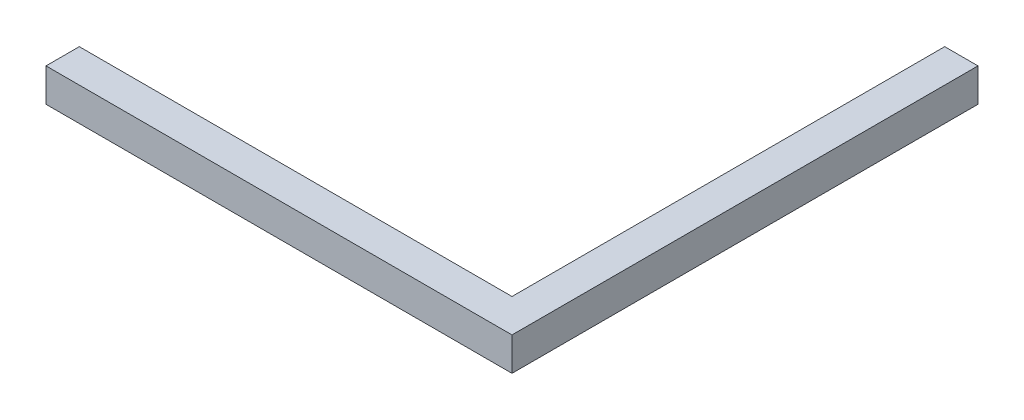
ISO-10303-21;
HEADER;
FILE_DESCRIPTION(('STEP AP214'),'2;1');
FILE_NAME('part.step','',(''),(''),'','','');
FILE_SCHEMA(('AUTOMOTIVE_DESIGN { 1 0 10303 214 1 1 1 1 }'));
ENDSEC;
DATA;
#1=APPLICATION_CONTEXT('core data for automotive mechanical design processes');
#2=APPLICATION_PROTOCOL_DEFINITION('international standard','automotive_design',2000,#1);
#3=PRODUCT_CONTEXT('',#1,'mechanical');
#4=PRODUCT('Part','Part','',(#3));
#5=PRODUCT_RELATED_PRODUCT_CATEGORY('part','',(#4));
#6=PRODUCT_DEFINITION_FORMATION('','',#4);
#7=PRODUCT_DEFINITION_CONTEXT('part definition',#1,'design');
#8=PRODUCT_DEFINITION('design','',#6,#7);
#9=PRODUCT_DEFINITION_SHAPE('','',#8);
#10=(LENGTH_UNIT() NAMED_UNIT(*) SI_UNIT(.MILLI.,.METRE.));
#11=(NAMED_UNIT(*) PLANE_ANGLE_UNIT() SI_UNIT($,.RADIAN.));
#12=(NAMED_UNIT(*) SI_UNIT($,.STERADIAN.) SOLID_ANGLE_UNIT());
#13=UNCERTAINTY_MEASURE_WITH_UNIT(LENGTH_MEASURE(1.E-05),#10,'distance_accuracy_value','');
#14=(GEOMETRIC_REPRESENTATION_CONTEXT(3) GLOBAL_UNCERTAINTY_ASSIGNED_CONTEXT((#13)) GLOBAL_UNIT_ASSIGNED_CONTEXT((#10,
#11,#12)) REPRESENTATION_CONTEXT('',''));
#15=CARTESIAN_POINT('',(0.,0.,0.));
#16=DIRECTION('',(0.,0.,1.));
#17=DIRECTION('',(1.,0.,0.));
#18=AXIS2_PLACEMENT_3D('',#15,#16,#17);
#19=CARTESIAN_POINT('',(70.,10.,70.));
#20=DIRECTION('',(-1.,0.,0.));
#21=DIRECTION('',(0.,0.,1.));
#22=AXIS2_PLACEMENT_3D('',#19,#20,#21);
#23=PLANE('',#22);
#24=DIRECTION('',(0.,0.,-1.));
#25=VECTOR('',#24,1.);
#26=CARTESIAN_POINT('',(70.,0.,70.));
#27=LINE('',#26,#25);
#28=CARTESIAN_POINT('',(70.,0.,70.));
#29=VERTEX_POINT('',#28);
#30=CARTESIAN_POINT('',(70.,0.,-70.));
#31=VERTEX_POINT('',#30);
#32=EDGE_CURVE('E118',#29,#31,#27,.T.);
#33=ORIENTED_EDGE('',*,*,#32,.T.);
#34=DIRECTION('',(0.,-1.,0.));
#35=VECTOR('',#34,1.);
#36=CARTESIAN_POINT('',(70.,10.,-70.));
#37=LINE('',#36,#35);
#38=CARTESIAN_POINT('',(70.,10.,-70.));
#39=VERTEX_POINT('',#38);
#40=EDGE_CURVE('E11',#39,#31,#37,.T.);
#41=ORIENTED_EDGE('',*,*,#40,.F.);
#42=DIRECTION('',(0.,0.,-1.));
#43=VECTOR('',#42,1.);
#44=CARTESIAN_POINT('',(70.,10.,70.));
#45=LINE('',#44,#43);
#46=CARTESIAN_POINT('',(70.,10.,70.));
#47=VERTEX_POINT('',#46);
#48=EDGE_CURVE('E128',#47,#39,#45,.T.);
#49=ORIENTED_EDGE('',*,*,#48,.F.);
#50=DIRECTION('',(0.,-1.,0.));
#51=VECTOR('',#50,1.);
#52=CARTESIAN_POINT('',(70.,10.,70.));
#53=LINE('',#52,#51);
#54=EDGE_CURVE('E114',#47,#29,#53,.T.);
#55=ORIENTED_EDGE('',*,*,#54,.T.);
#56=EDGE_LOOP('',(#33,#41,#49,#55));
#57=FACE_BOUND('',#56,.T.);
#58=ADVANCED_FACE('F34',(#57),#23,.F.);
#59=CARTESIAN_POINT('',(70.,10.,-70.));
#60=DIRECTION('',(0.,0.,1.));
#61=DIRECTION('',(1.,0.,0.));
#62=AXIS2_PLACEMENT_3D('',#59,#60,#61);
#63=PLANE('',#62);
#64=DIRECTION('',(-1.,0.,0.));
#65=VECTOR('',#64,1.);
#66=CARTESIAN_POINT('',(70.,0.,-70.));
#67=LINE('',#66,#65);
#68=CARTESIAN_POINT('',(60.,0.,-70.));
#69=VERTEX_POINT('',#68);
#70=EDGE_CURVE('E121',#31,#69,#67,.T.);
#71=ORIENTED_EDGE('',*,*,#70,.T.);
#72=DIRECTION('',(0.,-1.,0.));
#73=VECTOR('',#72,1.);
#74=CARTESIAN_POINT('',(60.,10.,-70.));
#75=LINE('',#74,#73);
#76=CARTESIAN_POINT('',(60.,10.,-70.));
#77=VERTEX_POINT('',#76);
#78=EDGE_CURVE('E42',#77,#69,#75,.T.);
#79=ORIENTED_EDGE('',*,*,#78,.F.);
#80=DIRECTION('',(-1.,0.,0.));
#81=VECTOR('',#80,1.);
#82=CARTESIAN_POINT('',(70.,10.,-70.));
#83=LINE('',#82,#81);
#84=EDGE_CURVE('E87',#39,#77,#83,.T.);
#85=ORIENTED_EDGE('',*,*,#84,.F.);
#86=ORIENTED_EDGE('',*,*,#40,.T.);
#87=EDGE_LOOP('',(#71,#79,#85,#86));
#88=FACE_BOUND('',#87,.T.);
#89=ADVANCED_FACE('F152',(#88),#63,.F.);
#90=CARTESIAN_POINT('',(60.,10.,-70.));
#91=DIRECTION('',(1.,0.,0.));
#92=DIRECTION('',(0.,0.,-1.));
#93=AXIS2_PLACEMENT_3D('',#90,#91,#92);
#94=PLANE('',#93);
#95=DIRECTION('',(0.,0.,1.));
#96=VECTOR('',#95,1.);
#97=CARTESIAN_POINT('',(60.,0.,-70.));
#98=LINE('',#97,#96);
#99=CARTESIAN_POINT('',(60.,0.,60.));
#100=VERTEX_POINT('',#99);
#101=EDGE_CURVE('E123',#69,#100,#98,.T.);
#102=ORIENTED_EDGE('',*,*,#101,.T.);
#103=DIRECTION('',(0.,-1.,0.));
#104=VECTOR('',#103,1.);
#105=CARTESIAN_POINT('',(60.,10.,60.));
#106=LINE('',#105,#104);
#107=CARTESIAN_POINT('',(60.,10.,60.));
#108=VERTEX_POINT('',#107);
#109=EDGE_CURVE('E109',#108,#100,#106,.T.);
#110=ORIENTED_EDGE('',*,*,#109,.F.);
#111=DIRECTION('',(0.,0.,1.));
#112=VECTOR('',#111,1.);
#113=CARTESIAN_POINT('',(60.,10.,-70.));
#114=LINE('',#113,#112);
#115=EDGE_CURVE('E100',#77,#108,#114,.T.);
#116=ORIENTED_EDGE('',*,*,#115,.F.);
#117=ORIENTED_EDGE('',*,*,#78,.T.);
#118=EDGE_LOOP('',(#102,#110,#116,#117));
#119=FACE_BOUND('',#118,.T.);
#120=ADVANCED_FACE('F134',(#119),#94,.F.);
#121=CARTESIAN_POINT('',(60.,10.,60.));
#122=DIRECTION('',(0.,0.,1.));
#123=DIRECTION('',(1.,0.,0.));
#124=AXIS2_PLACEMENT_3D('',#121,#122,#123);
#125=PLANE('',#124);
#126=DIRECTION('',(-1.,0.,0.));
#127=VECTOR('',#126,1.);
#128=CARTESIAN_POINT('',(60.,0.,60.));
#129=LINE('',#128,#127);
#130=CARTESIAN_POINT('',(-70.,0.,60.));
#131=VERTEX_POINT('',#130);
#132=EDGE_CURVE('E108',#100,#131,#129,.T.);
#133=ORIENTED_EDGE('',*,*,#132,.T.);
#134=DIRECTION('',(0.,-1.,0.));
#135=VECTOR('',#134,1.);
#136=CARTESIAN_POINT('',(-70.,10.,60.));
#137=LINE('',#136,#135);
#138=CARTESIAN_POINT('',(-70.,10.,60.));
#139=VERTEX_POINT('',#138);
#140=EDGE_CURVE('E105',#139,#131,#137,.T.);
#141=ORIENTED_EDGE('',*,*,#140,.F.);
#142=DIRECTION('',(-1.,0.,0.));
#143=VECTOR('',#142,1.);
#144=CARTESIAN_POINT('',(60.,10.,60.));
#145=LINE('',#144,#143);
#146=EDGE_CURVE('E94',#108,#139,#145,.T.);
#147=ORIENTED_EDGE('',*,*,#146,.F.);
#148=ORIENTED_EDGE('',*,*,#109,.T.);
#149=EDGE_LOOP('',(#133,#141,#147,#148));
#150=FACE_BOUND('',#149,.T.);
#151=ADVANCED_FACE('F106',(#150),#125,.F.);
#152=CARTESIAN_POINT('',(-70.,10.,60.));
#153=DIRECTION('',(1.,0.,0.));
#154=DIRECTION('',(0.,0.,-1.));
#155=AXIS2_PLACEMENT_3D('',#152,#153,#154);
#156=PLANE('',#155);
#157=DIRECTION('',(0.,0.,1.));
#158=VECTOR('',#157,1.);
#159=CARTESIAN_POINT('',(-70.,0.,60.));
#160=LINE('',#159,#158);
#161=CARTESIAN_POINT('',(-70.,0.,70.));
#162=VERTEX_POINT('',#161);
#163=EDGE_CURVE('E73',#131,#162,#160,.T.);
#164=ORIENTED_EDGE('',*,*,#163,.T.);
#165=DIRECTION('',(0.,-1.,0.));
#166=VECTOR('',#165,1.);
#167=CARTESIAN_POINT('',(-70.,10.,70.));
#168=LINE('',#167,#166);
#169=CARTESIAN_POINT('',(-70.,10.,70.));
#170=VERTEX_POINT('',#169);
#171=EDGE_CURVE('E110',#170,#162,#168,.T.);
#172=ORIENTED_EDGE('',*,*,#171,.F.);
#173=DIRECTION('',(0.,0.,1.));
#174=VECTOR('',#173,1.);
#175=CARTESIAN_POINT('',(-70.,10.,60.));
#176=LINE('',#175,#174);
#177=EDGE_CURVE('E98',#139,#170,#176,.T.);
#178=ORIENTED_EDGE('',*,*,#177,.F.);
#179=ORIENTED_EDGE('',*,*,#140,.T.);
#180=EDGE_LOOP('',(#164,#172,#178,#179));
#181=FACE_BOUND('',#180,.T.);
#182=ADVANCED_FACE('F112',(#181),#156,.F.);
#183=CARTESIAN_POINT('',(-70.,10.,70.));
#184=DIRECTION('',(0.,0.,-1.));
#185=DIRECTION('',(-1.,0.,0.));
#186=AXIS2_PLACEMENT_3D('',#183,#184,#185);
#187=PLANE('',#186);
#188=DIRECTION('',(1.,0.,0.));
#189=VECTOR('',#188,1.);
#190=CARTESIAN_POINT('',(-70.,0.,70.));
#191=LINE('',#190,#189);
#192=EDGE_CURVE('E79',#162,#29,#191,.T.);
#193=ORIENTED_EDGE('',*,*,#192,.T.);
#194=ORIENTED_EDGE('',*,*,#54,.F.);
#195=DIRECTION('',(1.,0.,0.));
#196=VECTOR('',#195,1.);
#197=CARTESIAN_POINT('',(-70.,10.,70.));
#198=LINE('',#197,#196);
#199=EDGE_CURVE('E50',#170,#47,#198,.T.);
#200=ORIENTED_EDGE('',*,*,#199,.F.);
#201=ORIENTED_EDGE('',*,*,#171,.T.);
#202=EDGE_LOOP('',(#193,#194,#200,#201));
#203=FACE_BOUND('',#202,.T.);
#204=ADVANCED_FACE('F141',(#203),#187,.F.);
#205=CARTESIAN_POINT('',(0.,10.,0.));
#206=DIRECTION('',(0.,1.,0.));
#207=DIRECTION('',(0.,0.,1.));
#208=AXIS2_PLACEMENT_3D('',#205,#206,#207);
#209=PLANE('',#208);
#210=ORIENTED_EDGE('',*,*,#48,.T.);
#211=ORIENTED_EDGE('',*,*,#84,.T.);
#212=ORIENTED_EDGE('',*,*,#115,.T.);
#213=ORIENTED_EDGE('',*,*,#146,.T.);
#214=ORIENTED_EDGE('',*,*,#177,.T.);
#215=ORIENTED_EDGE('',*,*,#199,.T.);
#216=EDGE_LOOP('',(#210,#211,#212,#213,#214,#215));
#217=FACE_BOUND('',#216,.T.);
#218=ADVANCED_FACE('F96',(#217),#209,.T.);
#219=CARTESIAN_POINT('',(0.,0.,0.));
#220=DIRECTION('',(0.,1.,0.));
#221=DIRECTION('',(0.,0.,1.));
#222=AXIS2_PLACEMENT_3D('',#219,#220,#221);
#223=PLANE('',#222);
#224=ORIENTED_EDGE('',*,*,#32,.F.);
#225=ORIENTED_EDGE('',*,*,#192,.F.);
#226=ORIENTED_EDGE('',*,*,#163,.F.);
#227=ORIENTED_EDGE('',*,*,#132,.F.);
#228=ORIENTED_EDGE('',*,*,#101,.F.);
#229=ORIENTED_EDGE('',*,*,#70,.F.);
#230=EDGE_LOOP('',(#224,#225,#226,#227,#228,#229));
#231=FACE_BOUND('',#230,.T.);
#232=ADVANCED_FACE('F137',(#231),#223,.F.);
#233=CLOSED_SHELL('',(#58,#89,#120,#151,#182,#204,#218,#232));
#234=MANIFOLD_SOLID_BREP('B2',#233);
#235=ADVANCED_BREP_SHAPE_REPRESENTATION('',(#18,#234),#14);
#236=SHAPE_DEFINITION_REPRESENTATION(#9,#235);
ENDSEC;
END-ISO-10303-21;
